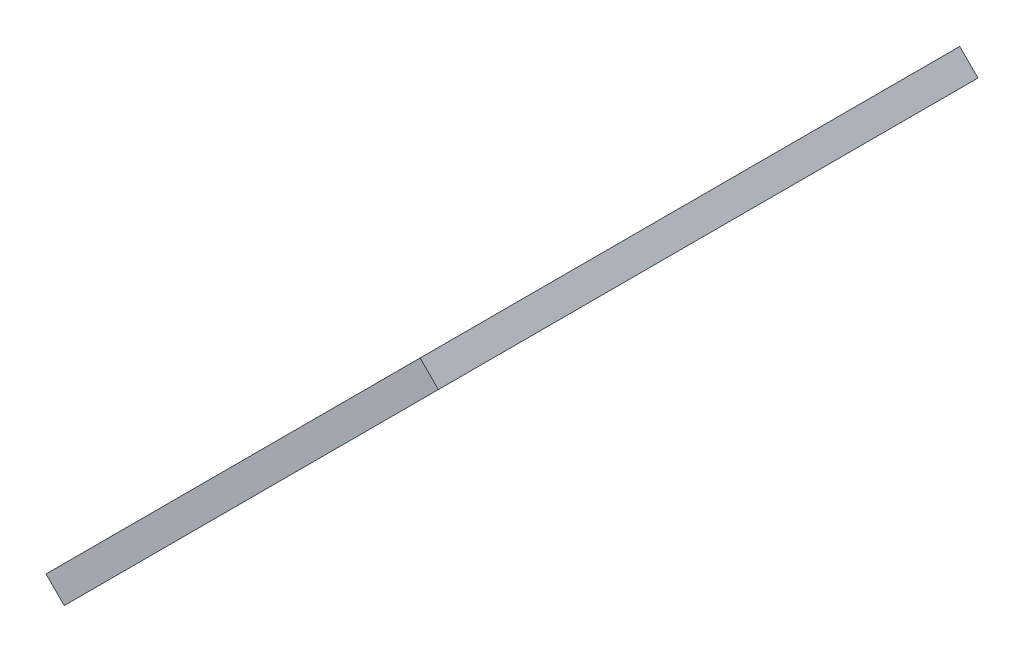
ISO-10303-21;
HEADER;
FILE_DESCRIPTION(('STEP AP214'),'2;1');
FILE_NAME('part.step','',(''),(''),'','','');
FILE_SCHEMA(('AUTOMOTIVE_DESIGN { 1 0 10303 214 1 1 1 1 }'));
ENDSEC;
DATA;
#1=APPLICATION_CONTEXT('core data for automotive mechanical design processes');
#2=APPLICATION_PROTOCOL_DEFINITION('international standard','automotive_design',2000,#1);
#3=PRODUCT_CONTEXT('',#1,'mechanical');
#4=PRODUCT('Part','Part','',(#3));
#5=PRODUCT_RELATED_PRODUCT_CATEGORY('part','',(#4));
#6=PRODUCT_DEFINITION_FORMATION('','',#4);
#7=PRODUCT_DEFINITION_CONTEXT('part definition',#1,'design');
#8=PRODUCT_DEFINITION('design','',#6,#7);
#9=PRODUCT_DEFINITION_SHAPE('','',#8);
#10=(LENGTH_UNIT() NAMED_UNIT(*) SI_UNIT(.MILLI.,.METRE.));
#11=(NAMED_UNIT(*) PLANE_ANGLE_UNIT() SI_UNIT($,.RADIAN.));
#12=(NAMED_UNIT(*) SI_UNIT($,.STERADIAN.) SOLID_ANGLE_UNIT());
#13=UNCERTAINTY_MEASURE_WITH_UNIT(LENGTH_MEASURE(1.E-05),#10,'distance_accuracy_value','');
#14=(GEOMETRIC_REPRESENTATION_CONTEXT(3) GLOBAL_UNCERTAINTY_ASSIGNED_CONTEXT((#13)) GLOBAL_UNIT_ASSIGNED_CONTEXT((#10,
#11,#12)) REPRESENTATION_CONTEXT('',''));
#15=CARTESIAN_POINT('',(0.,0.,0.));
#16=DIRECTION('',(0.,0.,1.));
#17=DIRECTION('',(1.,0.,0.));
#18=AXIS2_PLACEMENT_3D('',#15,#16,#17);
#19=CARTESIAN_POINT('',(44.2413911795844,-114.440269052434,48.412903324699));
#20=DIRECTION('',(0.707106781186548,0.707106781186547,0.));
#21=DIRECTION('',(-0.707106781186547,0.707106781186548,0.));
#22=AXIS2_PLACEMENT_3D('',#19,#20,#21);
#23=PLANE('',#22);
#24=DIRECTION('',(0.,0.,1.));
#25=VECTOR('',#24,1.);
#26=CARTESIAN_POINT('',(46.3627115231441,-116.561589395994,48.412903324699));
#27=LINE('',#26,#25);
#28=CARTESIAN_POINT('',(46.3627115231441,-116.561589395994,48.412903324699));
#29=VERTEX_POINT('',#28);
#30=CARTESIAN_POINT('',(46.3627115231441,-116.561589395994,111.164878));
#31=VERTEX_POINT('',#30);
#32=EDGE_CURVE('E113',#29,#31,#27,.T.);
#33=ORIENTED_EDGE('',*,*,#32,.F.);
#34=DIRECTION('',(0.707106781186547,-0.707106781186548,0.));
#35=VECTOR('',#34,1.);
#36=CARTESIAN_POINT('',(44.2413911795844,-114.440269052434,48.412903324699));
#37=LINE('',#36,#35);
#38=CARTESIAN_POINT('',(44.2413911795844,-114.440269052434,48.412903324699));
#39=VERTEX_POINT('',#38);
#40=EDGE_CURVE('E11',#39,#29,#37,.T.);
#41=ORIENTED_EDGE('',*,*,#40,.F.);
#42=DIRECTION('',(0.,0.,1.));
#43=VECTOR('',#42,1.);
#44=CARTESIAN_POINT('',(44.2413911795844,-114.440269052434,48.412903324699));
#45=LINE('',#44,#43);
#46=CARTESIAN_POINT('',(44.2413911795844,-114.440269052434,111.164878));
#47=VERTEX_POINT('',#46);
#48=EDGE_CURVE('E104',#39,#47,#45,.T.);
#49=ORIENTED_EDGE('',*,*,#48,.T.);
#50=DIRECTION('',(0.707106781186547,-0.707106781186548,0.));
#51=VECTOR('',#50,1.);
#52=CARTESIAN_POINT('',(44.2413911795844,-114.440269052434,111.164878));
#53=LINE('',#52,#51);
#54=EDGE_CURVE('E42',#47,#31,#53,.T.);
#55=ORIENTED_EDGE('',*,*,#54,.T.);
#56=EDGE_LOOP('',(#33,#41,#49,#55));
#57=FACE_BOUND('',#56,.T.);
#58=ADVANCED_FACE('F39',(#57),#23,.T.);
#59=CARTESIAN_POINT('',(0.735391052433972,-157.946269179584,4.90690319754843));
#60=DIRECTION('',(0.408248290463864,0.408248290463864,-0.816496580927725));
#61=DIRECTION('',(-0.894427190999915,0.,-0.447213595499959));
#62=AXIS2_PLACEMENT_3D('',#59,#60,#61);
#63=PLANE('',#62);
#64=DIRECTION('',(0.577350269189625,0.577350269189625,0.577350269189627));
#65=VECTOR('',#64,1.);
#66=CARTESIAN_POINT('',(2.85671139599361,-160.067589523144,4.90690319754843));
#67=LINE('',#66,#65);
#68=CARTESIAN_POINT('',(2.85671139599361,-160.067589523144,4.90690319754843));
#69=VERTEX_POINT('',#68);
#70=EDGE_CURVE('E109',#69,#29,#67,.T.);
#71=ORIENTED_EDGE('',*,*,#70,.F.);
#72=DIRECTION('',(0.707106781186547,-0.707106781186548,0.));
#73=VECTOR('',#72,1.);
#74=CARTESIAN_POINT('',(0.735391052433972,-157.946269179584,4.90690319754843));
#75=LINE('',#74,#73);
#76=CARTESIAN_POINT('',(0.735391052433972,-157.946269179584,4.90690319754843));
#77=VERTEX_POINT('',#76);
#78=EDGE_CURVE('E48',#77,#69,#75,.T.);
#79=ORIENTED_EDGE('',*,*,#78,.F.);
#80=DIRECTION('',(0.577350269189625,0.577350269189625,0.577350269189627));
#81=VECTOR('',#80,1.);
#82=CARTESIAN_POINT('',(0.735391052433972,-157.946269179584,4.90690319754843));
#83=LINE('',#82,#81);
#84=EDGE_CURVE('E99',#77,#39,#83,.T.);
#85=ORIENTED_EDGE('',*,*,#84,.T.);
#86=ORIENTED_EDGE('',*,*,#40,.T.);
#87=EDGE_LOOP('',(#71,#79,#85,#86));
#88=FACE_BOUND('',#87,.T.);
#89=ADVANCED_FACE('F126',(#88),#63,.T.);
#90=CARTESIAN_POINT('',(0.735391052433958,-157.946269179584,111.164878));
#91=DIRECTION('',(-0.707106781186548,-0.707106781186547,0.));
#92=DIRECTION('',(0.707106781186547,-0.707106781186548,0.));
#93=AXIS2_PLACEMENT_3D('',#90,#91,#92);
#94=PLANE('',#93);
#95=DIRECTION('',(0.,0.,-1.));
#96=VECTOR('',#95,1.);
#97=CARTESIAN_POINT('',(2.8567113959936,-160.067589523144,111.164878));
#98=LINE('',#97,#96);
#99=CARTESIAN_POINT('',(2.8567113959936,-160.067589523144,111.164878));
#100=VERTEX_POINT('',#99);
#101=EDGE_CURVE('E93',#100,#69,#98,.T.);
#102=ORIENTED_EDGE('',*,*,#101,.F.);
#103=DIRECTION('',(0.707106781186547,-0.707106781186548,0.));
#104=VECTOR('',#103,1.);
#105=CARTESIAN_POINT('',(0.735391052433958,-157.946269179584,111.164878));
#106=LINE('',#105,#104);
#107=CARTESIAN_POINT('',(0.735391052433958,-157.946269179584,111.164878));
#108=VERTEX_POINT('',#107);
#109=EDGE_CURVE('E88',#108,#100,#106,.T.);
#110=ORIENTED_EDGE('',*,*,#109,.F.);
#111=DIRECTION('',(0.,0.,-1.));
#112=VECTOR('',#111,1.);
#113=CARTESIAN_POINT('',(0.735391052433958,-157.946269179584,111.164878));
#114=LINE('',#113,#112);
#115=EDGE_CURVE('E91',#108,#77,#114,.T.);
#116=ORIENTED_EDGE('',*,*,#115,.T.);
#117=ORIENTED_EDGE('',*,*,#78,.T.);
#118=EDGE_LOOP('',(#102,#110,#116,#117));
#119=FACE_BOUND('',#118,.T.);
#120=ADVANCED_FACE('F90',(#119),#94,.T.);
#121=CARTESIAN_POINT('',(44.2413911795844,-114.440269052434,111.164878));
#122=DIRECTION('',(0.,0.,1.));
#123=DIRECTION('',(1.,0.,0.));
#124=AXIS2_PLACEMENT_3D('',#121,#122,#123);
#125=PLANE('',#124);
#126=DIRECTION('',(-0.707106781186547,-0.707106781186548,0.));
#127=VECTOR('',#126,1.);
#128=CARTESIAN_POINT('',(46.3627115231441,-116.561589395994,111.164878));
#129=LINE('',#128,#127);
#130=EDGE_CURVE('E117',#31,#100,#129,.T.);
#131=ORIENTED_EDGE('',*,*,#130,.F.);
#132=ORIENTED_EDGE('',*,*,#54,.F.);
#133=DIRECTION('',(-0.707106781186547,-0.707106781186548,0.));
#134=VECTOR('',#133,1.);
#135=CARTESIAN_POINT('',(44.2413911795844,-114.440269052434,111.164878));
#136=LINE('',#135,#134);
#137=EDGE_CURVE('E98',#47,#108,#136,.T.);
#138=ORIENTED_EDGE('',*,*,#137,.T.);
#139=ORIENTED_EDGE('',*,*,#109,.T.);
#140=EDGE_LOOP('',(#131,#132,#138,#139));
#141=FACE_BOUND('',#140,.T.);
#142=ADVANCED_FACE('F102',(#141),#125,.T.);
#143=CARTESIAN_POINT('',(79.3408301160092,-79.3408301160092,0.));
#144=DIRECTION('',(0.707106781186548,-0.707106781186547,0.));
#145=DIRECTION('',(0.707106781186547,0.707106781186548,0.));
#146=AXIS2_PLACEMENT_3D('',#143,#144,#145);
#147=PLANE('',#146);
#148=ORIENTED_EDGE('',*,*,#48,.F.);
#149=ORIENTED_EDGE('',*,*,#84,.F.);
#150=ORIENTED_EDGE('',*,*,#115,.F.);
#151=ORIENTED_EDGE('',*,*,#137,.F.);
#152=EDGE_LOOP('',(#148,#149,#150,#151));
#153=FACE_BOUND('',#152,.T.);
#154=ADVANCED_FACE('F97',(#153),#147,.F.);
#155=CARTESIAN_POINT('',(81.4621504595688,-81.4621504595688,0.));
#156=DIRECTION('',(0.707106781186548,-0.707106781186547,0.));
#157=DIRECTION('',(0.707106781186547,0.707106781186548,0.));
#158=AXIS2_PLACEMENT_3D('',#155,#156,#157);
#159=PLANE('',#158);
#160=ORIENTED_EDGE('',*,*,#32,.T.);
#161=ORIENTED_EDGE('',*,*,#130,.T.);
#162=ORIENTED_EDGE('',*,*,#101,.T.);
#163=ORIENTED_EDGE('',*,*,#70,.T.);
#164=EDGE_LOOP('',(#160,#161,#162,#163));
#165=FACE_BOUND('',#164,.T.);
#166=ADVANCED_FACE('F125',(#165),#159,.T.);
#167=CLOSED_SHELL('',(#58,#89,#120,#142,#154,#166));
#168=MANIFOLD_SOLID_BREP('B2',#167);
#169=ADVANCED_BREP_SHAPE_REPRESENTATION('',(#18,#168),#14);
#170=SHAPE_DEFINITION_REPRESENTATION(#9,#169);
ENDSEC;
END-ISO-10303-21;
